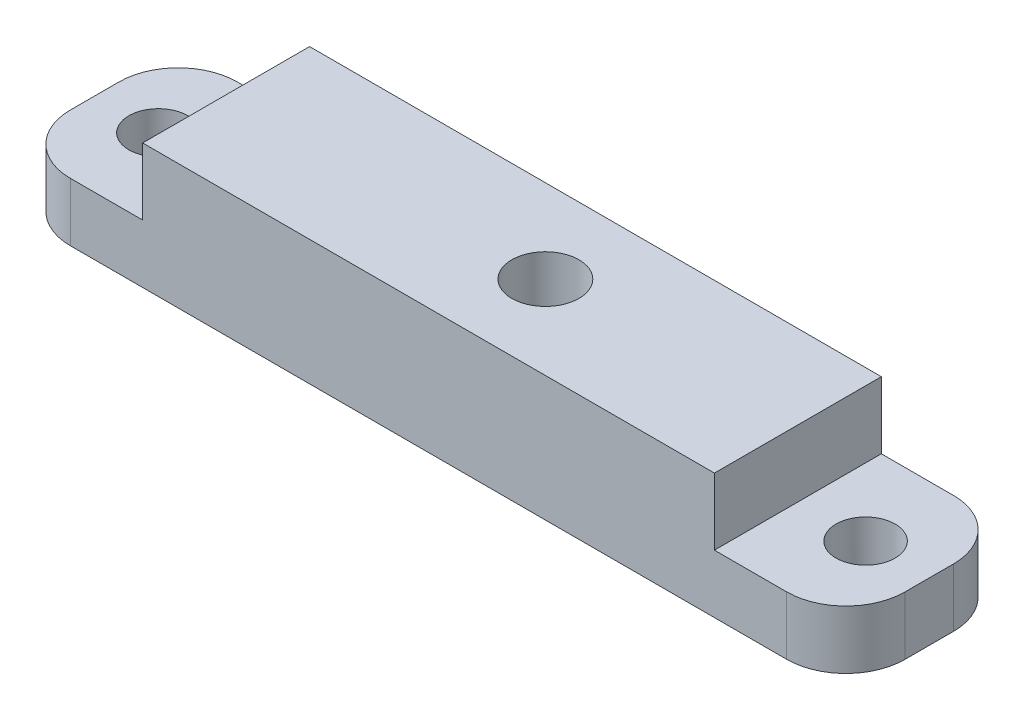
ISO-10303-21;
HEADER;
FILE_DESCRIPTION(('STEP AP214'),'2;1');
FILE_NAME('part.step','',(''),(''),'','','');
FILE_SCHEMA(('AUTOMOTIVE_DESIGN { 1 0 10303 214 1 1 1 1 }'));
ENDSEC;
DATA;
#1=APPLICATION_CONTEXT('core data for automotive mechanical design processes');
#2=APPLICATION_PROTOCOL_DEFINITION('international standard','automotive_design',2000,#1);
#3=PRODUCT_CONTEXT('',#1,'mechanical');
#4=PRODUCT('Part','Part','',(#3));
#5=PRODUCT_RELATED_PRODUCT_CATEGORY('part','',(#4));
#6=PRODUCT_DEFINITION_FORMATION('','',#4);
#7=PRODUCT_DEFINITION_CONTEXT('part definition',#1,'design');
#8=PRODUCT_DEFINITION('design','',#6,#7);
#9=PRODUCT_DEFINITION_SHAPE('','',#8);
#10=(LENGTH_UNIT() NAMED_UNIT(*) SI_UNIT(.MILLI.,.METRE.));
#11=(NAMED_UNIT(*) PLANE_ANGLE_UNIT() SI_UNIT($,.RADIAN.));
#12=(NAMED_UNIT(*) SI_UNIT($,.STERADIAN.) SOLID_ANGLE_UNIT());
#13=UNCERTAINTY_MEASURE_WITH_UNIT(LENGTH_MEASURE(1.E-05),#10,'distance_accuracy_value','');
#14=(GEOMETRIC_REPRESENTATION_CONTEXT(3) GLOBAL_UNCERTAINTY_ASSIGNED_CONTEXT((#13)) GLOBAL_UNIT_ASSIGNED_CONTEXT((#10,
#11,#12)) REPRESENTATION_CONTEXT('',''));
#15=CARTESIAN_POINT('',(0.,0.,0.));
#16=DIRECTION('',(0.,0.,1.));
#17=DIRECTION('',(1.,0.,0.));
#18=AXIS2_PLACEMENT_3D('',#15,#16,#17);
#19=CARTESIAN_POINT('',(-31.75,9.525,-6.34999999999999));
#20=DIRECTION('',(1.,0.,0.));
#21=DIRECTION('',(0.,0.,-1.));
#22=AXIS2_PLACEMENT_3D('',#19,#20,#21);
#23=PLANE('',#22);
#24=DIRECTION('',(0.,0.,1.));
#25=VECTOR('',#24,1.);
#26=CARTESIAN_POINT('',(-31.75,0.,-6.34999999999999));
#27=LINE('',#26,#25);
#28=CARTESIAN_POINT('',(-31.75,0.,-1.84999999999999));
#29=VERTEX_POINT('',#28);
#30=CARTESIAN_POINT('',(-31.75,0.,1.84999999999999));
#31=VERTEX_POINT('',#30);
#32=EDGE_CURVE('E204',#29,#31,#27,.T.);
#33=ORIENTED_EDGE('',*,*,#32,.T.);
#34=DIRECTION('',(0.,-1.,0.));
#35=VECTOR('',#34,1.);
#36=CARTESIAN_POINT('',(-31.75,9.525,1.84999999999999));
#37=LINE('',#36,#35);
#38=CARTESIAN_POINT('',(-31.75,4.445,1.84999999999999));
#39=VERTEX_POINT('',#38);
#40=EDGE_CURVE('E180',#31,#39,#37,.F.);
#41=ORIENTED_EDGE('',*,*,#40,.T.);
#42=DIRECTION('',(0.,0.,1.));
#43=VECTOR('',#42,1.);
#44=CARTESIAN_POINT('',(-31.75,4.445,-6.34999999999999));
#45=LINE('',#44,#43);
#46=CARTESIAN_POINT('',(-31.75,4.445,-1.84999999999999));
#47=VERTEX_POINT('',#46);
#48=EDGE_CURVE('E232',#47,#39,#45,.T.);
#49=ORIENTED_EDGE('',*,*,#48,.F.);
#50=DIRECTION('',(0.,-1.,0.));
#51=VECTOR('',#50,1.);
#52=CARTESIAN_POINT('',(-31.75,9.525,-1.84999999999999));
#53=LINE('',#52,#51);
#54=EDGE_CURVE('E177',#47,#29,#53,.T.);
#55=ORIENTED_EDGE('',*,*,#54,.T.);
#56=EDGE_LOOP('',(#33,#41,#49,#55));
#57=FACE_BOUND('',#56,.T.);
#58=ADVANCED_FACE('F33',(#57),#23,.F.);
#59=CARTESIAN_POINT('',(-26.9,9.525,0.));
#60=DIRECTION('',(0.,1.,0.));
#61=DIRECTION('',(0.,0.,1.));
#62=AXIS2_PLACEMENT_3D('',#59,#60,#61);
#63=CYLINDRICAL_SURFACE('',#62,2.24789999999999);
#64=CARTESIAN_POINT('',(-26.9,0.,0.));
#65=DIRECTION('',(0.,1.,0.));
#66=DIRECTION('',(0.,0.,1.));
#67=AXIS2_PLACEMENT_3D('',#64,#65,#66);
#68=CIRCLE('',#67,2.24789999999999);
#69=CARTESIAN_POINT('',(-26.9,0.,2.24789999999999));
#70=VERTEX_POINT('',#69);
#71=EDGE_CURVE('E161',#70,#70,#68,.T.);
#72=ORIENTED_EDGE('',*,*,#71,.F.);
#73=EDGE_LOOP('',(#72));
#74=FACE_BOUND('',#73,.T.);
#75=CARTESIAN_POINT('',(-26.9,4.44500000000001,0.));
#76=DIRECTION('',(0.,1.,0.));
#77=DIRECTION('',(0.,0.,1.));
#78=AXIS2_PLACEMENT_3D('',#75,#76,#77);
#79=CIRCLE('',#78,2.24789999999999);
#80=CARTESIAN_POINT('',(-26.9,4.44500000000001,2.24789999999999));
#81=VERTEX_POINT('',#80);
#82=EDGE_CURVE('E158',#81,#81,#79,.F.);
#83=ORIENTED_EDGE('',*,*,#82,.F.);
#84=EDGE_LOOP('',(#83));
#85=FACE_BOUND('',#84,.T.);
#86=ADVANCED_FACE('F283',(#74,#85),#63,.F.);
#87=CARTESIAN_POINT('',(-31.75,9.525,6.34999999999999));
#88=DIRECTION('',(0.,0.,-1.));
#89=DIRECTION('',(-1.,0.,0.));
#90=AXIS2_PLACEMENT_3D('',#87,#88,#89);
#91=PLANE('',#90);
#92=DIRECTION('',(1.,0.,0.));
#93=VECTOR('',#92,1.);
#94=CARTESIAN_POINT('',(-31.75,4.44500000000001,6.34999999999999));
#95=LINE('',#94,#93);
#96=CARTESIAN_POINT('',(-27.25,4.44500000000001,6.34999999999999));
#97=VERTEX_POINT('',#96);
#98=CARTESIAN_POINT('',(-21.75,4.44500000000001,6.34999999999999));
#99=VERTEX_POINT('',#98);
#100=EDGE_CURVE('E230',#97,#99,#95,.T.);
#101=ORIENTED_EDGE('',*,*,#100,.F.);
#102=DIRECTION('',(0.,-1.,0.));
#103=VECTOR('',#102,1.);
#104=CARTESIAN_POINT('',(-27.25,9.525,6.34999999999999));
#105=LINE('',#104,#103);
#106=CARTESIAN_POINT('',(-27.25,0.,6.34999999999999));
#107=VERTEX_POINT('',#106);
#108=EDGE_CURVE('E166',#97,#107,#105,.T.);
#109=ORIENTED_EDGE('',*,*,#108,.T.);
#110=DIRECTION('',(1.,0.,0.));
#111=VECTOR('',#110,1.);
#112=CARTESIAN_POINT('',(-31.75,0.,6.34999999999999));
#113=LINE('',#112,#111);
#114=CARTESIAN_POINT('',(27.25,0.,6.34999999999999));
#115=VERTEX_POINT('',#114);
#116=EDGE_CURVE('E203',#107,#115,#113,.T.);
#117=ORIENTED_EDGE('',*,*,#116,.T.);
#118=DIRECTION('',(0.,-1.,0.));
#119=VECTOR('',#118,1.);
#120=CARTESIAN_POINT('',(27.25,9.525,6.34999999999999));
#121=LINE('',#120,#119);
#122=CARTESIAN_POINT('',(27.25,4.445,6.34999999999999));
#123=VERTEX_POINT('',#122);
#124=EDGE_CURVE('E151',#115,#123,#121,.F.);
#125=ORIENTED_EDGE('',*,*,#124,.T.);
#126=DIRECTION('',(1.,0.,0.));
#127=VECTOR('',#126,1.);
#128=CARTESIAN_POINT('',(31.75,4.445,6.34999999999999));
#129=LINE('',#128,#127);
#130=CARTESIAN_POINT('',(21.75,4.445,6.34999999999999));
#131=VERTEX_POINT('',#130);
#132=EDGE_CURVE('E140',#131,#123,#129,.T.);
#133=ORIENTED_EDGE('',*,*,#132,.F.);
#134=DIRECTION('',(0.,1.,0.));
#135=VECTOR('',#134,1.);
#136=CARTESIAN_POINT('',(21.75,4.445,6.34999999999999));
#137=LINE('',#136,#135);
#138=CARTESIAN_POINT('',(21.75,9.525,6.34999999999999));
#139=VERTEX_POINT('',#138);
#140=EDGE_CURVE('E124',#131,#139,#137,.T.);
#141=ORIENTED_EDGE('',*,*,#140,.T.);
#142=DIRECTION('',(1.,0.,0.));
#143=VECTOR('',#142,1.);
#144=CARTESIAN_POINT('',(-31.75,9.525,6.34999999999999));
#145=LINE('',#144,#143);
#146=CARTESIAN_POINT('',(-21.75,9.52500000000001,6.34999999999999));
#147=VERTEX_POINT('',#146);
#148=EDGE_CURVE('E139',#147,#139,#145,.T.);
#149=ORIENTED_EDGE('',*,*,#148,.F.);
#150=DIRECTION('',(0.,1.,0.));
#151=VECTOR('',#150,1.);
#152=CARTESIAN_POINT('',(-21.75,4.44500000000001,6.34999999999999));
#153=LINE('',#152,#151);
#154=EDGE_CURVE('E220',#99,#147,#153,.T.);
#155=ORIENTED_EDGE('',*,*,#154,.F.);
#156=EDGE_LOOP('',(#101,#109,#117,#125,#133,#141,#149,#155));
#157=FACE_BOUND('',#156,.T.);
#158=ADVANCED_FACE('F137',(#157),#91,.F.);
#159=CARTESIAN_POINT('',(31.75,9.525,-6.34999999999999));
#160=DIRECTION('',(-1.,0.,0.));
#161=DIRECTION('',(0.,0.,1.));
#162=AXIS2_PLACEMENT_3D('',#159,#160,#161);
#163=PLANE('',#162);
#164=DIRECTION('',(0.,0.,-1.));
#165=VECTOR('',#164,1.);
#166=CARTESIAN_POINT('',(31.75,0.,-6.34999999999999));
#167=LINE('',#166,#165);
#168=CARTESIAN_POINT('',(31.75,0.,1.84999999999999));
#169=VERTEX_POINT('',#168);
#170=CARTESIAN_POINT('',(31.75,0.,-1.84999999999999));
#171=VERTEX_POINT('',#170);
#172=EDGE_CURVE('E154',#169,#171,#167,.T.);
#173=ORIENTED_EDGE('',*,*,#172,.T.);
#174=DIRECTION('',(0.,-1.,0.));
#175=VECTOR('',#174,1.);
#176=CARTESIAN_POINT('',(31.75,9.525,-1.84999999999999));
#177=LINE('',#176,#175);
#178=CARTESIAN_POINT('',(31.75,4.445,-1.84999999999999));
#179=VERTEX_POINT('',#178);
#180=EDGE_CURVE('E47',#171,#179,#177,.F.);
#181=ORIENTED_EDGE('',*,*,#180,.T.);
#182=DIRECTION('',(0.,0.,-1.));
#183=VECTOR('',#182,1.);
#184=CARTESIAN_POINT('',(31.75,4.445,-6.34999999999999));
#185=LINE('',#184,#183);
#186=CARTESIAN_POINT('',(31.75,4.445,1.84999999999999));
#187=VERTEX_POINT('',#186);
#188=EDGE_CURVE('E131',#187,#179,#185,.T.);
#189=ORIENTED_EDGE('',*,*,#188,.F.);
#190=DIRECTION('',(0.,-1.,0.));
#191=VECTOR('',#190,1.);
#192=CARTESIAN_POINT('',(31.75,9.525,1.84999999999999));
#193=LINE('',#192,#191);
#194=EDGE_CURVE('E191',#187,#169,#193,.T.);
#195=ORIENTED_EDGE('',*,*,#194,.T.);
#196=EDGE_LOOP('',(#173,#181,#189,#195));
#197=FACE_BOUND('',#196,.T.);
#198=ADVANCED_FACE('F196',(#197),#163,.F.);
#199=CARTESIAN_POINT('',(-31.75,9.525,-6.34999999999999));
#200=DIRECTION('',(0.,0.,1.));
#201=DIRECTION('',(1.,0.,0.));
#202=AXIS2_PLACEMENT_3D('',#199,#200,#201);
#203=PLANE('',#202);
#204=DIRECTION('',(-1.,0.,0.));
#205=VECTOR('',#204,1.);
#206=CARTESIAN_POINT('',(-31.75,0.,-6.34999999999999));
#207=LINE('',#206,#205);
#208=CARTESIAN_POINT('',(27.25,0.,-6.34999999999999));
#209=VERTEX_POINT('',#208);
#210=CARTESIAN_POINT('',(-27.25,0.,-6.34999999999999));
#211=VERTEX_POINT('',#210);
#212=EDGE_CURVE('E149',#209,#211,#207,.T.);
#213=ORIENTED_EDGE('',*,*,#212,.T.);
#214=DIRECTION('',(0.,-1.,0.));
#215=VECTOR('',#214,1.);
#216=CARTESIAN_POINT('',(-27.25,9.525,-6.34999999999999));
#217=LINE('',#216,#215);
#218=CARTESIAN_POINT('',(-27.25,4.445,-6.34999999999999));
#219=VERTEX_POINT('',#218);
#220=EDGE_CURVE('E189',#211,#219,#217,.F.);
#221=ORIENTED_EDGE('',*,*,#220,.T.);
#222=DIRECTION('',(-1.,0.,0.));
#223=VECTOR('',#222,1.);
#224=CARTESIAN_POINT('',(-31.75,4.445,-6.34999999999999));
#225=LINE('',#224,#223);
#226=CARTESIAN_POINT('',(-21.75,4.445,-6.34999999999999));
#227=VERTEX_POINT('',#226);
#228=EDGE_CURVE('E222',#227,#219,#225,.T.);
#229=ORIENTED_EDGE('',*,*,#228,.F.);
#230=DIRECTION('',(0.,1.,0.));
#231=VECTOR('',#230,1.);
#232=CARTESIAN_POINT('',(-21.75,4.445,-6.34999999999999));
#233=LINE('',#232,#231);
#234=CARTESIAN_POINT('',(-21.75,9.52500000000001,-6.34999999999999));
#235=VERTEX_POINT('',#234);
#236=EDGE_CURVE('E162',#227,#235,#233,.T.);
#237=ORIENTED_EDGE('',*,*,#236,.T.);
#238=DIRECTION('',(-1.,0.,0.));
#239=VECTOR('',#238,1.);
#240=CARTESIAN_POINT('',(-31.75,9.525,-6.34999999999999));
#241=LINE('',#240,#239);
#242=CARTESIAN_POINT('',(21.75,9.525,-6.34999999999999));
#243=VERTEX_POINT('',#242);
#244=EDGE_CURVE('E148',#243,#235,#241,.T.);
#245=ORIENTED_EDGE('',*,*,#244,.F.);
#246=DIRECTION('',(0.,1.,0.));
#247=VECTOR('',#246,1.);
#248=CARTESIAN_POINT('',(21.75,4.445,-6.34999999999999));
#249=LINE('',#248,#247);
#250=CARTESIAN_POINT('',(21.75,4.445,-6.34999999999999));
#251=VERTEX_POINT('',#250);
#252=EDGE_CURVE('E127',#251,#243,#249,.T.);
#253=ORIENTED_EDGE('',*,*,#252,.F.);
#254=DIRECTION('',(-1.,0.,0.));
#255=VECTOR('',#254,1.);
#256=CARTESIAN_POINT('',(31.75,4.445,-6.34999999999999));
#257=LINE('',#256,#255);
#258=CARTESIAN_POINT('',(27.25,4.445,-6.34999999999999));
#259=VERTEX_POINT('',#258);
#260=EDGE_CURVE('E240',#259,#251,#257,.T.);
#261=ORIENTED_EDGE('',*,*,#260,.F.);
#262=DIRECTION('',(0.,-1.,0.));
#263=VECTOR('',#262,1.);
#264=CARTESIAN_POINT('',(27.25,9.525,-6.34999999999999));
#265=LINE('',#264,#263);
#266=EDGE_CURVE('E186',#259,#209,#265,.T.);
#267=ORIENTED_EDGE('',*,*,#266,.T.);
#268=EDGE_LOOP('',(#213,#221,#229,#237,#245,#253,#261,#267));
#269=FACE_BOUND('',#268,.T.);
#270=ADVANCED_FACE('F250',(#269),#203,.F.);
#271=CARTESIAN_POINT('',(-31.75,9.525,6.34999999999999));
#272=DIRECTION('',(0.,1.,0.));
#273=DIRECTION('',(0.,0.,1.));
#274=AXIS2_PLACEMENT_3D('',#271,#272,#273);
#275=PLANE('',#274);
#276=DIRECTION('',(0.,0.,1.));
#277=VECTOR('',#276,1.);
#278=CARTESIAN_POINT('',(21.75,9.525,-6.34999999999999));
#279=LINE('',#278,#277);
#280=EDGE_CURVE('E120',#243,#139,#279,.T.);
#281=ORIENTED_EDGE('',*,*,#280,.F.);
#282=ORIENTED_EDGE('',*,*,#244,.T.);
#283=DIRECTION('',(0.,0.,-1.));
#284=VECTOR('',#283,1.);
#285=CARTESIAN_POINT('',(-21.75,9.52500000000001,-6.34999999999999));
#286=LINE('',#285,#284);
#287=EDGE_CURVE('E147',#147,#235,#286,.T.);
#288=ORIENTED_EDGE('',*,*,#287,.F.);
#289=ORIENTED_EDGE('',*,*,#148,.T.);
#290=EDGE_LOOP('',(#281,#282,#288,#289));
#291=FACE_BOUND('',#290,.T.);
#292=CARTESIAN_POINT('',(2.54,9.525,0.));
#293=DIRECTION('',(0.,1.,0.));
#294=DIRECTION('',(0.,0.,1.));
#295=AXIS2_PLACEMENT_3D('',#292,#293,#294);
#296=CIRCLE('',#295,2.5527);
#297=CARTESIAN_POINT('',(2.54,9.525,2.5527));
#298=VERTEX_POINT('',#297);
#299=EDGE_CURVE('E209',#298,#298,#296,.T.);
#300=ORIENTED_EDGE('',*,*,#299,.F.);
#301=EDGE_LOOP('',(#300));
#302=FACE_BOUND('',#301,.T.);
#303=ADVANCED_FACE('F144',(#291,#302),#275,.T.);
#304=CARTESIAN_POINT('',(-31.75,0.,6.34999999999999));
#305=DIRECTION('',(0.,1.,0.));
#306=DIRECTION('',(0.,0.,1.));
#307=AXIS2_PLACEMENT_3D('',#304,#305,#306);
#308=PLANE('',#307);
#309=ORIENTED_EDGE('',*,*,#71,.T.);
#310=EDGE_LOOP('',(#309));
#311=FACE_BOUND('',#310,.T.);
#312=CARTESIAN_POINT('',(26.9,0.,0.));
#313=DIRECTION('',(0.,1.,0.));
#314=DIRECTION('',(0.,0.,1.));
#315=AXIS2_PLACEMENT_3D('',#312,#313,#314);
#316=CIRCLE('',#315,2.24789999999999);
#317=CARTESIAN_POINT('',(26.9,0.,2.24789999999999));
#318=VERTEX_POINT('',#317);
#319=EDGE_CURVE('E215',#318,#318,#316,.T.);
#320=ORIENTED_EDGE('',*,*,#319,.T.);
#321=EDGE_LOOP('',(#320));
#322=FACE_BOUND('',#321,.T.);
#323=CARTESIAN_POINT('',(2.54,0.,0.));
#324=DIRECTION('',(0.,1.,0.));
#325=DIRECTION('',(0.,0.,1.));
#326=AXIS2_PLACEMENT_3D('',#323,#324,#325);
#327=CIRCLE('',#326,2.5527);
#328=CARTESIAN_POINT('',(2.54,0.,2.5527));
#329=VERTEX_POINT('',#328);
#330=EDGE_CURVE('E212',#329,#329,#327,.T.);
#331=ORIENTED_EDGE('',*,*,#330,.T.);
#332=EDGE_LOOP('',(#331));
#333=FACE_BOUND('',#332,.T.);
#334=ORIENTED_EDGE('',*,*,#116,.F.);
#335=CARTESIAN_POINT('',(-27.25,0.,1.84999999999999));
#336=DIRECTION('',(0.,1.,0.));
#337=DIRECTION('',(0.,0.,1.));
#338=AXIS2_PLACEMENT_3D('',#335,#336,#337);
#339=CIRCLE('',#338,4.5);
#340=EDGE_CURVE('E175',#107,#31,#339,.F.);
#341=ORIENTED_EDGE('',*,*,#340,.T.);
#342=ORIENTED_EDGE('',*,*,#32,.F.);
#343=CARTESIAN_POINT('',(-27.25,0.,-1.84999999999999));
#344=DIRECTION('',(0.,1.,0.));
#345=DIRECTION('',(0.,0.,1.));
#346=AXIS2_PLACEMENT_3D('',#343,#344,#345);
#347=CIRCLE('',#346,4.5);
#348=EDGE_CURVE('E173',#29,#211,#347,.F.);
#349=ORIENTED_EDGE('',*,*,#348,.T.);
#350=ORIENTED_EDGE('',*,*,#212,.F.);
#351=CARTESIAN_POINT('',(27.25,0.,-1.84999999999999));
#352=DIRECTION('',(0.,1.,0.));
#353=DIRECTION('',(0.,0.,1.));
#354=AXIS2_PLACEMENT_3D('',#351,#352,#353);
#355=CIRCLE('',#354,4.5);
#356=EDGE_CURVE('E171',#209,#171,#355,.F.);
#357=ORIENTED_EDGE('',*,*,#356,.T.);
#358=ORIENTED_EDGE('',*,*,#172,.F.);
#359=CARTESIAN_POINT('',(27.25,0.,1.84999999999999));
#360=DIRECTION('',(0.,1.,0.));
#361=DIRECTION('',(0.,0.,1.));
#362=AXIS2_PLACEMENT_3D('',#359,#360,#361);
#363=CIRCLE('',#362,4.5);
#364=EDGE_CURVE('E169',#169,#115,#363,.F.);
#365=ORIENTED_EDGE('',*,*,#364,.T.);
#366=EDGE_LOOP('',(#334,#341,#342,#349,#350,#357,#358,#365));
#367=FACE_BOUND('',#366,.T.);
#368=ADVANCED_FACE('F200',(#311,#322,#333,#367),#308,.F.);
#369=CARTESIAN_POINT('',(2.54,9.525,0.));
#370=DIRECTION('',(0.,1.,0.));
#371=DIRECTION('',(0.,0.,1.));
#372=AXIS2_PLACEMENT_3D('',#369,#370,#371);
#373=CYLINDRICAL_SURFACE('',#372,2.5527);
#374=ORIENTED_EDGE('',*,*,#330,.F.);
#375=EDGE_LOOP('',(#374));
#376=FACE_BOUND('',#375,.T.);
#377=ORIENTED_EDGE('',*,*,#299,.T.);
#378=EDGE_LOOP('',(#377));
#379=FACE_BOUND('',#378,.T.);
#380=ADVANCED_FACE('F296',(#376,#379),#373,.F.);
#381=CARTESIAN_POINT('',(26.9,9.525,0.));
#382=DIRECTION('',(0.,1.,0.));
#383=DIRECTION('',(0.,0.,1.));
#384=AXIS2_PLACEMENT_3D('',#381,#382,#383);
#385=CYLINDRICAL_SURFACE('',#384,2.24789999999999);
#386=CARTESIAN_POINT('',(26.9,4.445,0.));
#387=DIRECTION('',(0.,-1.,0.));
#388=DIRECTION('',(0.,0.,-1.));
#389=AXIS2_PLACEMENT_3D('',#386,#387,#388);
#390=CIRCLE('',#389,2.24789999999999);
#391=CARTESIAN_POINT('',(26.9,4.445,-2.24789999999999));
#392=VERTEX_POINT('',#391);
#393=EDGE_CURVE('E141',#392,#392,#390,.F.);
#394=ORIENTED_EDGE('',*,*,#393,.T.);
#395=EDGE_LOOP('',(#394));
#396=FACE_BOUND('',#395,.T.);
#397=ORIENTED_EDGE('',*,*,#319,.F.);
#398=EDGE_LOOP('',(#397));
#399=FACE_BOUND('',#398,.T.);
#400=ADVANCED_FACE('F279',(#396,#399),#385,.F.);
#401=CARTESIAN_POINT('',(-31.75,4.44500000000001,6.34999999999999));
#402=DIRECTION('',(0.,1.,0.));
#403=DIRECTION('',(0.,0.,1.));
#404=AXIS2_PLACEMENT_3D('',#401,#402,#403);
#405=PLANE('',#404);
#406=ORIENTED_EDGE('',*,*,#48,.T.);
#407=CARTESIAN_POINT('',(-27.25,4.44500000000001,1.84999999999999));
#408=DIRECTION('',(0.,1.,0.));
#409=DIRECTION('',(0.,0.,1.));
#410=AXIS2_PLACEMENT_3D('',#407,#408,#409);
#411=CIRCLE('',#410,4.5);
#412=EDGE_CURVE('E184',#39,#97,#411,.T.);
#413=ORIENTED_EDGE('',*,*,#412,.T.);
#414=ORIENTED_EDGE('',*,*,#100,.T.);
#415=DIRECTION('',(0.,0.,-1.));
#416=VECTOR('',#415,1.);
#417=CARTESIAN_POINT('',(-21.75,4.445,-6.34999999999999));
#418=LINE('',#417,#416);
#419=EDGE_CURVE('E227',#99,#227,#418,.T.);
#420=ORIENTED_EDGE('',*,*,#419,.T.);
#421=ORIENTED_EDGE('',*,*,#228,.T.);
#422=CARTESIAN_POINT('',(-27.25,4.44500000000001,-1.84999999999999));
#423=DIRECTION('',(0.,1.,0.));
#424=DIRECTION('',(0.,0.,1.));
#425=AXIS2_PLACEMENT_3D('',#422,#423,#424);
#426=CIRCLE('',#425,4.5);
#427=EDGE_CURVE('E182',#219,#47,#426,.T.);
#428=ORIENTED_EDGE('',*,*,#427,.T.);
#429=EDGE_LOOP('',(#406,#413,#414,#420,#421,#428));
#430=FACE_BOUND('',#429,.T.);
#431=ORIENTED_EDGE('',*,*,#82,.T.);
#432=EDGE_LOOP('',(#431));
#433=FACE_BOUND('',#432,.T.);
#434=ADVANCED_FACE('F262',(#430,#433),#405,.T.);
#435=CARTESIAN_POINT('',(-21.75,4.445,-6.34999999999999));
#436=DIRECTION('',(1.,0.,0.));
#437=DIRECTION('',(0.,0.,-1.));
#438=AXIS2_PLACEMENT_3D('',#435,#436,#437);
#439=PLANE('',#438);
#440=ORIENTED_EDGE('',*,*,#287,.T.);
#441=ORIENTED_EDGE('',*,*,#236,.F.);
#442=ORIENTED_EDGE('',*,*,#419,.F.);
#443=ORIENTED_EDGE('',*,*,#154,.T.);
#444=EDGE_LOOP('',(#440,#441,#442,#443));
#445=FACE_BOUND('',#444,.T.);
#446=ADVANCED_FACE('F271',(#445),#439,.F.);
#447=CARTESIAN_POINT('',(31.75,4.445,6.34999999999999));
#448=DIRECTION('',(0.,-1.,0.));
#449=DIRECTION('',(0.,0.,-1.));
#450=AXIS2_PLACEMENT_3D('',#447,#448,#449);
#451=PLANE('',#450);
#452=ORIENTED_EDGE('',*,*,#188,.T.);
#453=CARTESIAN_POINT('',(27.25,4.445,-1.84999999999999));
#454=DIRECTION('',(0.,-1.,0.));
#455=DIRECTION('',(0.,0.,-1.));
#456=AXIS2_PLACEMENT_3D('',#453,#454,#455);
#457=CIRCLE('',#456,4.5);
#458=EDGE_CURVE('E11',#179,#259,#457,.F.);
#459=ORIENTED_EDGE('',*,*,#458,.T.);
#460=ORIENTED_EDGE('',*,*,#260,.T.);
#461=DIRECTION('',(0.,0.,1.));
#462=VECTOR('',#461,1.);
#463=CARTESIAN_POINT('',(21.75,4.445,-6.34999999999999));
#464=LINE('',#463,#462);
#465=EDGE_CURVE('E238',#251,#131,#464,.T.);
#466=ORIENTED_EDGE('',*,*,#465,.T.);
#467=ORIENTED_EDGE('',*,*,#132,.T.);
#468=CARTESIAN_POINT('',(27.25,4.445,1.84999999999999));
#469=DIRECTION('',(0.,-1.,0.));
#470=DIRECTION('',(0.,0.,-1.));
#471=AXIS2_PLACEMENT_3D('',#468,#469,#470);
#472=CIRCLE('',#471,4.5);
#473=EDGE_CURVE('E40',#123,#187,#472,.F.);
#474=ORIENTED_EDGE('',*,*,#473,.T.);
#475=EDGE_LOOP('',(#452,#459,#460,#466,#467,#474));
#476=FACE_BOUND('',#475,.T.);
#477=ORIENTED_EDGE('',*,*,#393,.F.);
#478=EDGE_LOOP('',(#477));
#479=FACE_BOUND('',#478,.T.);
#480=ADVANCED_FACE('F243',(#476,#479),#451,.F.);
#481=CARTESIAN_POINT('',(21.75,4.445,-6.34999999999999));
#482=DIRECTION('',(-1.,0.,0.));
#483=DIRECTION('',(0.,0.,1.));
#484=AXIS2_PLACEMENT_3D('',#481,#482,#483);
#485=PLANE('',#484);
#486=ORIENTED_EDGE('',*,*,#280,.T.);
#487=ORIENTED_EDGE('',*,*,#140,.F.);
#488=ORIENTED_EDGE('',*,*,#465,.F.);
#489=ORIENTED_EDGE('',*,*,#252,.T.);
#490=EDGE_LOOP('',(#486,#487,#488,#489));
#491=FACE_BOUND('',#490,.T.);
#492=ADVANCED_FACE('F122',(#491),#485,.F.);
#493=CARTESIAN_POINT('',(-27.25,9.525,1.84999999999999));
#494=DIRECTION('',(0.,-1.,0.));
#495=DIRECTION('',(0.,0.,-1.));
#496=AXIS2_PLACEMENT_3D('',#493,#494,#495);
#497=CYLINDRICAL_SURFACE('',#496,4.5);
#498=ORIENTED_EDGE('',*,*,#412,.F.);
#499=ORIENTED_EDGE('',*,*,#40,.F.);
#500=ORIENTED_EDGE('',*,*,#340,.F.);
#501=ORIENTED_EDGE('',*,*,#108,.F.);
#502=EDGE_LOOP('',(#498,#499,#500,#501));
#503=FACE_BOUND('',#502,.T.);
#504=ADVANCED_FACE('F266',(#503),#497,.T.);
#505=CARTESIAN_POINT('',(-27.25,9.525,-1.84999999999999));
#506=DIRECTION('',(0.,-1.,0.));
#507=DIRECTION('',(0.,0.,-1.));
#508=AXIS2_PLACEMENT_3D('',#505,#506,#507);
#509=CYLINDRICAL_SURFACE('',#508,4.5);
#510=ORIENTED_EDGE('',*,*,#427,.F.);
#511=ORIENTED_EDGE('',*,*,#220,.F.);
#512=ORIENTED_EDGE('',*,*,#348,.F.);
#513=ORIENTED_EDGE('',*,*,#54,.F.);
#514=EDGE_LOOP('',(#510,#511,#512,#513));
#515=FACE_BOUND('',#514,.T.);
#516=ADVANCED_FACE('F256',(#515),#509,.T.);
#517=CARTESIAN_POINT('',(27.25,9.525,-1.84999999999999));
#518=DIRECTION('',(0.,-1.,0.));
#519=DIRECTION('',(0.,0.,-1.));
#520=AXIS2_PLACEMENT_3D('',#517,#518,#519);
#521=CYLINDRICAL_SURFACE('',#520,4.5);
#522=ORIENTED_EDGE('',*,*,#458,.F.);
#523=ORIENTED_EDGE('',*,*,#180,.F.);
#524=ORIENTED_EDGE('',*,*,#356,.F.);
#525=ORIENTED_EDGE('',*,*,#266,.F.);
#526=EDGE_LOOP('',(#522,#523,#524,#525));
#527=FACE_BOUND('',#526,.T.);
#528=ADVANCED_FACE('F248',(#527),#521,.T.);
#529=CARTESIAN_POINT('',(27.25,9.525,1.84999999999999));
#530=DIRECTION('',(0.,-1.,0.));
#531=DIRECTION('',(0.,0.,-1.));
#532=AXIS2_PLACEMENT_3D('',#529,#530,#531);
#533=CYLINDRICAL_SURFACE('',#532,4.5);
#534=ORIENTED_EDGE('',*,*,#473,.F.);
#535=ORIENTED_EDGE('',*,*,#124,.F.);
#536=ORIENTED_EDGE('',*,*,#364,.F.);
#537=ORIENTED_EDGE('',*,*,#194,.F.);
#538=EDGE_LOOP('',(#534,#535,#536,#537));
#539=FACE_BOUND('',#538,.T.);
#540=ADVANCED_FACE('F370',(#539),#533,.T.);
#541=CLOSED_SHELL('',(#58,#86,#158,#198,#270,#303,#368,#380,#400,#434,#446,#480,#492,#504,#516,
#528,#540));
#542=MANIFOLD_SOLID_BREP('B2',#541);
#543=ADVANCED_BREP_SHAPE_REPRESENTATION('',(#18,#542),#14);
#544=SHAPE_DEFINITION_REPRESENTATION(#9,#543);
ENDSEC;
END-ISO-10303-21;
